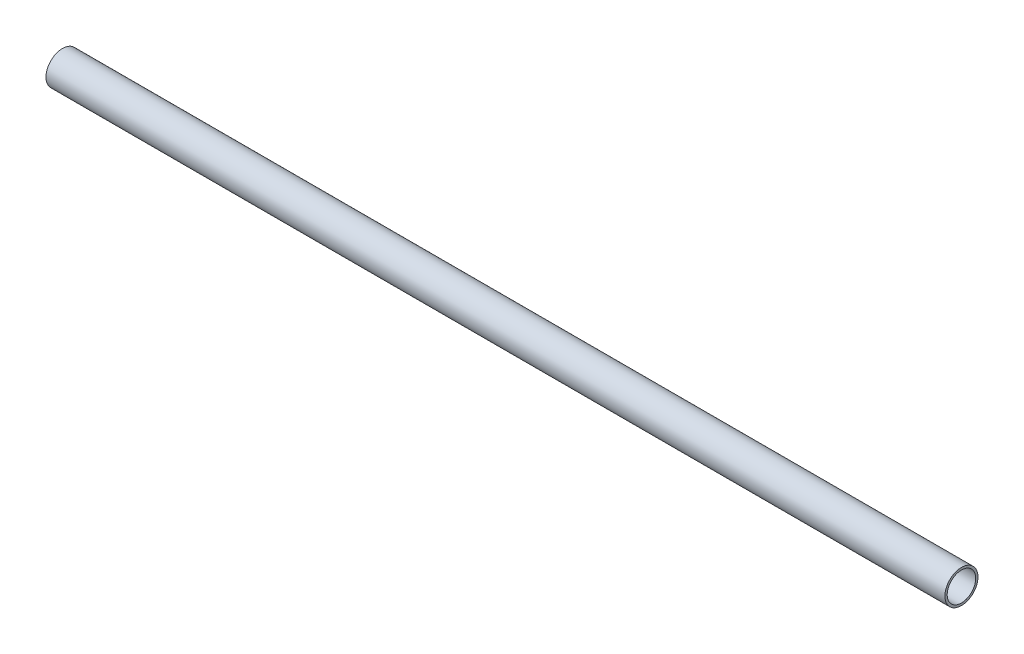
ISO-10303-21;
HEADER;
FILE_DESCRIPTION(('STEP AP214'),'2;1');
FILE_NAME('part.step','',(''),(''),'','','');
FILE_SCHEMA(('AUTOMOTIVE_DESIGN { 1 0 10303 214 1 1 1 1 }'));
ENDSEC;
DATA;
#1=APPLICATION_CONTEXT('core data for automotive mechanical design processes');
#2=APPLICATION_PROTOCOL_DEFINITION('international standard','automotive_design',2000,#1);
#3=PRODUCT_CONTEXT('',#1,'mechanical');
#4=PRODUCT('Part','Part','',(#3));
#5=PRODUCT_RELATED_PRODUCT_CATEGORY('part','',(#4));
#6=PRODUCT_DEFINITION_FORMATION('','',#4);
#7=PRODUCT_DEFINITION_CONTEXT('part definition',#1,'design');
#8=PRODUCT_DEFINITION('design','',#6,#7);
#9=PRODUCT_DEFINITION_SHAPE('','',#8);
#10=(LENGTH_UNIT() NAMED_UNIT(*) SI_UNIT(.MILLI.,.METRE.));
#11=(NAMED_UNIT(*) PLANE_ANGLE_UNIT() SI_UNIT($,.RADIAN.));
#12=(NAMED_UNIT(*) SI_UNIT($,.STERADIAN.) SOLID_ANGLE_UNIT());
#13=UNCERTAINTY_MEASURE_WITH_UNIT(LENGTH_MEASURE(1.E-05),#10,'distance_accuracy_value','');
#14=(GEOMETRIC_REPRESENTATION_CONTEXT(3) GLOBAL_UNCERTAINTY_ASSIGNED_CONTEXT((#13)) GLOBAL_UNIT_ASSIGNED_CONTEXT((#10,
#11,#12)) REPRESENTATION_CONTEXT('',''));
#15=CARTESIAN_POINT('',(0.,0.,0.));
#16=DIRECTION('',(0.,0.,1.));
#17=DIRECTION('',(1.,0.,0.));
#18=AXIS2_PLACEMENT_3D('',#15,#16,#17);
#19=CARTESIAN_POINT('',(40.,0.,0.));
#20=DIRECTION('',(1.,0.,0.));
#21=DIRECTION('',(0.,0.,-1.));
#22=AXIS2_PLACEMENT_3D('',#19,#20,#21);
#23=PLANE('',#22);
#24=CARTESIAN_POINT('',(40.,0.,0.));
#25=DIRECTION('',(1.,0.,0.));
#26=DIRECTION('',(0.,0.,-1.));
#27=AXIS2_PLACEMENT_3D('',#24,#25,#26);
#28=CIRCLE('',#27,0.7366);
#29=CARTESIAN_POINT('',(40.,0.,-0.7366));
#30=VERTEX_POINT('',#29);
#31=EDGE_CURVE('E10',#30,#30,#28,.T.);
#32=ORIENTED_EDGE('',*,*,#31,.T.);
#33=EDGE_LOOP('',(#32));
#34=FACE_BOUND('',#33,.T.);
#35=CARTESIAN_POINT('',(40.,0.,0.));
#36=DIRECTION('',(1.,0.,0.));
#37=DIRECTION('',(0.,0.,-1.));
#38=AXIS2_PLACEMENT_3D('',#35,#36,#37);
#39=CIRCLE('',#38,0.635);
#40=CARTESIAN_POINT('',(40.,0.,-0.635));
#41=VERTEX_POINT('',#40);
#42=EDGE_CURVE('E41',#41,#41,#39,.T.);
#43=ORIENTED_EDGE('',*,*,#42,.F.);
#44=EDGE_LOOP('',(#43));
#45=FACE_BOUND('',#44,.T.);
#46=ADVANCED_FACE('F30',(#34,#45),#23,.T.);
#47=CARTESIAN_POINT('',(0.,0.,0.));
#48=DIRECTION('',(1.,0.,0.));
#49=DIRECTION('',(0.,0.,-1.));
#50=AXIS2_PLACEMENT_3D('',#47,#48,#49);
#51=PLANE('',#50);
#52=CARTESIAN_POINT('',(0.,0.,0.));
#53=DIRECTION('',(1.,0.,0.));
#54=DIRECTION('',(0.,0.,-1.));
#55=AXIS2_PLACEMENT_3D('',#52,#53,#54);
#56=CIRCLE('',#55,0.7366);
#57=CARTESIAN_POINT('',(0.,0.,-0.7366));
#58=VERTEX_POINT('',#57);
#59=EDGE_CURVE('E34',#58,#58,#56,.T.);
#60=ORIENTED_EDGE('',*,*,#59,.F.);
#61=EDGE_LOOP('',(#60));
#62=FACE_BOUND('',#61,.T.);
#63=CARTESIAN_POINT('',(0.,0.,0.));
#64=DIRECTION('',(1.,0.,0.));
#65=DIRECTION('',(0.,0.,-1.));
#66=AXIS2_PLACEMENT_3D('',#63,#64,#65);
#67=CIRCLE('',#66,0.635);
#68=CARTESIAN_POINT('',(0.,0.,-0.635));
#69=VERTEX_POINT('',#68);
#70=EDGE_CURVE('E43',#69,#69,#67,.T.);
#71=ORIENTED_EDGE('',*,*,#70,.T.);
#72=EDGE_LOOP('',(#71));
#73=FACE_BOUND('',#72,.T.);
#74=ADVANCED_FACE('F53',(#62,#73),#51,.F.);
#75=CARTESIAN_POINT('',(40.,0.,0.));
#76=DIRECTION('',(-1.,0.,0.));
#77=DIRECTION('',(0.,0.,1.));
#78=AXIS2_PLACEMENT_3D('',#75,#76,#77);
#79=CYLINDRICAL_SURFACE('',#78,0.7366);
#80=ORIENTED_EDGE('',*,*,#31,.F.);
#81=EDGE_LOOP('',(#80));
#82=FACE_BOUND('',#81,.T.);
#83=ORIENTED_EDGE('',*,*,#59,.T.);
#84=EDGE_LOOP('',(#83));
#85=FACE_BOUND('',#84,.T.);
#86=ADVANCED_FACE('F32',(#82,#85),#79,.T.);
#87=CARTESIAN_POINT('',(40.,0.,0.));
#88=DIRECTION('',(-1.,0.,0.));
#89=DIRECTION('',(0.,0.,1.));
#90=AXIS2_PLACEMENT_3D('',#87,#88,#89);
#91=CYLINDRICAL_SURFACE('',#90,0.635);
#92=ORIENTED_EDGE('',*,*,#42,.T.);
#93=EDGE_LOOP('',(#92));
#94=FACE_BOUND('',#93,.T.);
#95=ORIENTED_EDGE('',*,*,#70,.F.);
#96=EDGE_LOOP('',(#95));
#97=FACE_BOUND('',#96,.T.);
#98=ADVANCED_FACE('F49',(#94,#97),#91,.F.);
#99=CLOSED_SHELL('',(#46,#74,#86,#98));
#100=MANIFOLD_SOLID_BREP('B2',#99);
#101=ADVANCED_BREP_SHAPE_REPRESENTATION('',(#18,#100),#14);
#102=SHAPE_DEFINITION_REPRESENTATION(#9,#101);
ENDSEC;
END-ISO-10303-21;
